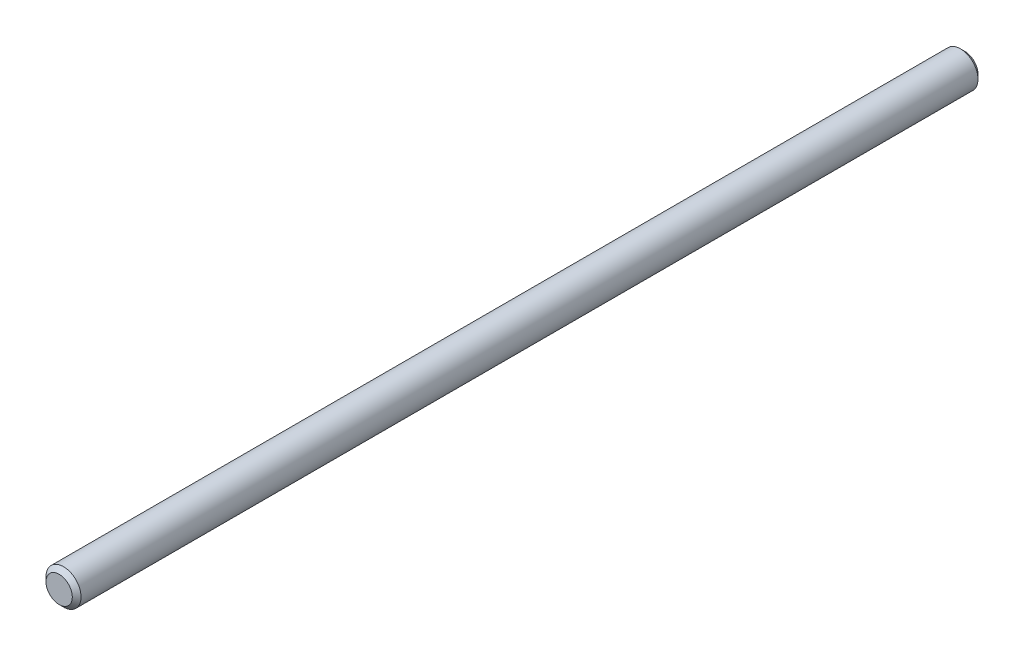
ISO-10303-21;
HEADER;
FILE_DESCRIPTION(('STEP AP214'),'2;1');
FILE_NAME('part.step','',(''),(''),'','','');
FILE_SCHEMA(('AUTOMOTIVE_DESIGN { 1 0 10303 214 1 1 1 1 }'));
ENDSEC;
DATA;
#1=APPLICATION_CONTEXT('core data for automotive mechanical design processes');
#2=APPLICATION_PROTOCOL_DEFINITION('international standard','automotive_design',2000,#1);
#3=PRODUCT_CONTEXT('',#1,'mechanical');
#4=PRODUCT('Part','Part','',(#3));
#5=PRODUCT_RELATED_PRODUCT_CATEGORY('part','',(#4));
#6=PRODUCT_DEFINITION_FORMATION('','',#4);
#7=PRODUCT_DEFINITION_CONTEXT('part definition',#1,'design');
#8=PRODUCT_DEFINITION('design','',#6,#7);
#9=PRODUCT_DEFINITION_SHAPE('','',#8);
#10=(LENGTH_UNIT() NAMED_UNIT(*) SI_UNIT(.MILLI.,.METRE.));
#11=(NAMED_UNIT(*) PLANE_ANGLE_UNIT() SI_UNIT($,.RADIAN.));
#12=(NAMED_UNIT(*) SI_UNIT($,.STERADIAN.) SOLID_ANGLE_UNIT());
#13=UNCERTAINTY_MEASURE_WITH_UNIT(LENGTH_MEASURE(1.E-05),#10,'distance_accuracy_value','');
#14=(GEOMETRIC_REPRESENTATION_CONTEXT(3) GLOBAL_UNCERTAINTY_ASSIGNED_CONTEXT((#13)) GLOBAL_UNIT_ASSIGNED_CONTEXT((#10,
#11,#12)) REPRESENTATION_CONTEXT('',''));
#15=CARTESIAN_POINT('',(0.,0.,0.));
#16=DIRECTION('',(0.,0.,1.));
#17=DIRECTION('',(1.,0.,0.));
#18=AXIS2_PLACEMENT_3D('',#15,#16,#17);
#19=CARTESIAN_POINT('',(0.,0.,310.));
#20=DIRECTION('',(0.,0.,-1.));
#21=DIRECTION('',(-1.,0.,0.));
#22=AXIS2_PLACEMENT_3D('',#19,#20,#21);
#23=CYLINDRICAL_SURFACE('',#22,6.);
#24=CARTESIAN_POINT('',(0.,0.,1.5));
#25=DIRECTION('',(0.,0.,1.));
#26=DIRECTION('',(1.,0.,0.));
#27=AXIS2_PLACEMENT_3D('',#24,#25,#26);
#28=CIRCLE('',#27,6.);
#29=CARTESIAN_POINT('',(6.,0.,1.5));
#30=VERTEX_POINT('',#29);
#31=EDGE_CURVE('E44',#30,#30,#28,.T.);
#32=ORIENTED_EDGE('',*,*,#31,.T.);
#33=EDGE_LOOP('',(#32));
#34=FACE_BOUND('',#33,.T.);
#35=CARTESIAN_POINT('',(0.,0.,308.5));
#36=DIRECTION('',(0.,0.,1.));
#37=DIRECTION('',(1.,0.,0.));
#38=AXIS2_PLACEMENT_3D('',#35,#36,#37);
#39=CIRCLE('',#38,6.);
#40=CARTESIAN_POINT('',(6.00000000000002,0.,308.5));
#41=VERTEX_POINT('',#40);
#42=EDGE_CURVE('E48',#41,#41,#39,.F.);
#43=ORIENTED_EDGE('',*,*,#42,.T.);
#44=EDGE_LOOP('',(#43));
#45=FACE_BOUND('',#44,.T.);
#46=ADVANCED_FACE('F34',(#34,#45),#23,.T.);
#47=CARTESIAN_POINT('',(0.,0.,310.));
#48=DIRECTION('',(0.,0.,1.));
#49=DIRECTION('',(1.,0.,0.));
#50=AXIS2_PLACEMENT_3D('',#47,#48,#49);
#51=PLANE('',#50);
#52=CARTESIAN_POINT('',(0.,0.,310.));
#53=DIRECTION('',(0.,0.,1.));
#54=DIRECTION('',(1.,0.,0.));
#55=AXIS2_PLACEMENT_3D('',#52,#53,#54);
#56=CIRCLE('',#55,4.5);
#57=CARTESIAN_POINT('',(4.50000000000001,0.,310.));
#58=VERTEX_POINT('',#57);
#59=EDGE_CURVE('E10',#58,#58,#56,.T.);
#60=ORIENTED_EDGE('',*,*,#59,.T.);
#61=EDGE_LOOP('',(#60));
#62=FACE_BOUND('',#61,.T.);
#63=ADVANCED_FACE('F67',(#62),#51,.T.);
#64=CARTESIAN_POINT('',(0.,0.,0.));
#65=DIRECTION('',(0.,0.,1.));
#66=DIRECTION('',(1.,0.,0.));
#67=AXIS2_PLACEMENT_3D('',#64,#65,#66);
#68=PLANE('',#67);
#69=CARTESIAN_POINT('',(0.,0.,0.));
#70=DIRECTION('',(0.,0.,1.));
#71=DIRECTION('',(1.,0.,0.));
#72=AXIS2_PLACEMENT_3D('',#69,#70,#71);
#73=CIRCLE('',#72,4.49999999999999);
#74=CARTESIAN_POINT('',(4.49999999999999,0.,0.));
#75=VERTEX_POINT('',#74);
#76=EDGE_CURVE('E40',#75,#75,#73,.F.);
#77=ORIENTED_EDGE('',*,*,#76,.T.);
#78=EDGE_LOOP('',(#77));
#79=FACE_BOUND('',#78,.T.);
#80=ADVANCED_FACE('F63',(#79),#68,.F.);
#81=CARTESIAN_POINT('',(0.,0.,1.5));
#82=DIRECTION('',(0.,0.,1.));
#83=DIRECTION('',(1.,0.,0.));
#84=AXIS2_PLACEMENT_3D('',#81,#82,#83);
#85=CONICAL_SURFACE('',#84,6.,0.785398163397451);
#86=ORIENTED_EDGE('',*,*,#76,.F.);
#87=EDGE_LOOP('',(#86));
#88=FACE_BOUND('',#87,.T.);
#89=ORIENTED_EDGE('',*,*,#31,.F.);
#90=EDGE_LOOP('',(#89));
#91=FACE_BOUND('',#90,.T.);
#92=ADVANCED_FACE('F58',(#88,#91),#85,.T.);
#93=CARTESIAN_POINT('',(0.,0.,310.));
#94=DIRECTION('',(0.,0.,-1.));
#95=DIRECTION('',(-1.,0.,0.));
#96=AXIS2_PLACEMENT_3D('',#93,#94,#95);
#97=CONICAL_SURFACE('',#96,4.5,0.785398163397449);
#98=ORIENTED_EDGE('',*,*,#42,.F.);
#99=EDGE_LOOP('',(#98));
#100=FACE_BOUND('',#99,.T.);
#101=ORIENTED_EDGE('',*,*,#59,.F.);
#102=EDGE_LOOP('',(#101));
#103=FACE_BOUND('',#102,.T.);
#104=ADVANCED_FACE('F55',(#100,#103),#97,.T.);
#105=CLOSED_SHELL('',(#46,#63,#80,#92,#104));
#106=MANIFOLD_SOLID_BREP('B2',#105);
#107=ADVANCED_BREP_SHAPE_REPRESENTATION('',(#18,#106),#14);
#108=SHAPE_DEFINITION_REPRESENTATION(#9,#107);
ENDSEC;
END-ISO-10303-21;
